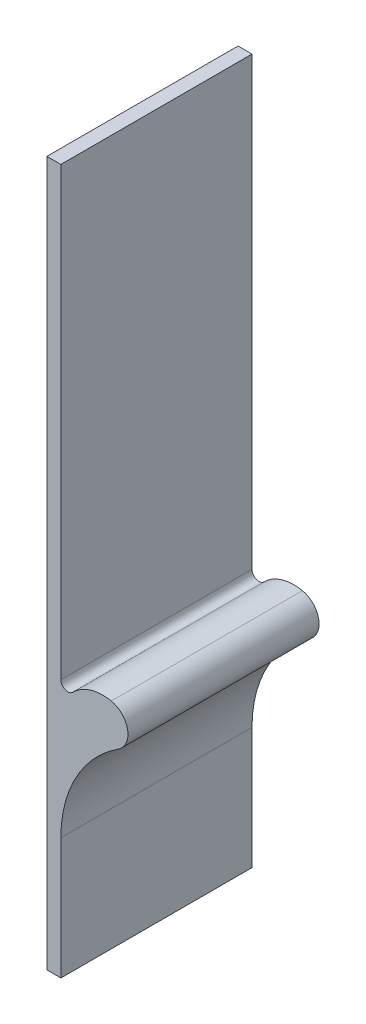
ISO-10303-21;
HEADER;
FILE_DESCRIPTION(('STEP AP214'),'2;1');
FILE_NAME('part.step','',(''),(''),'','','');
FILE_SCHEMA(('AUTOMOTIVE_DESIGN { 1 0 10303 214 1 1 1 1 }'));
ENDSEC;
DATA;
#1=APPLICATION_CONTEXT('core data for automotive mechanical design processes');
#2=APPLICATION_PROTOCOL_DEFINITION('international standard','automotive_design',2000,#1);
#3=PRODUCT_CONTEXT('',#1,'mechanical');
#4=PRODUCT('Part','Part','',(#3));
#5=PRODUCT_RELATED_PRODUCT_CATEGORY('part','',(#4));
#6=PRODUCT_DEFINITION_FORMATION('','',#4);
#7=PRODUCT_DEFINITION_CONTEXT('part definition',#1,'design');
#8=PRODUCT_DEFINITION('design','',#6,#7);
#9=PRODUCT_DEFINITION_SHAPE('','',#8);
#10=(LENGTH_UNIT() NAMED_UNIT(*) SI_UNIT(.MILLI.,.METRE.));
#11=(NAMED_UNIT(*) PLANE_ANGLE_UNIT() SI_UNIT($,.RADIAN.));
#12=(NAMED_UNIT(*) SI_UNIT($,.STERADIAN.) SOLID_ANGLE_UNIT());
#13=UNCERTAINTY_MEASURE_WITH_UNIT(LENGTH_MEASURE(1.E-05),#10,'distance_accuracy_value','');
#14=(GEOMETRIC_REPRESENTATION_CONTEXT(3) GLOBAL_UNCERTAINTY_ASSIGNED_CONTEXT((#13)) GLOBAL_UNIT_ASSIGNED_CONTEXT((#10,
#11,#12)) REPRESENTATION_CONTEXT('',''));
#15=CARTESIAN_POINT('',(0.,0.,0.));
#16=DIRECTION('',(0.,0.,1.));
#17=DIRECTION('',(1.,0.,0.));
#18=AXIS2_PLACEMENT_3D('',#15,#16,#17);
#19=CARTESIAN_POINT('',(162.,-79.9866466970703,-133.266873352892));
#20=DIRECTION('',(0.,0.,1.));
#21=DIRECTION('',(1.,0.,0.));
#22=AXIS2_PLACEMENT_3D('',#19,#20,#21);
#23=CYLINDRICAL_SURFACE('',#22,0.5);
#24=DIRECTION('',(0.,0.,1.));
#25=VECTOR('',#24,1.);
#26=CARTESIAN_POINT('',(162.357142857143,-80.3365738031821,-133.266873352892));
#27=LINE('',#26,#25);
#28=CARTESIAN_POINT('',(162.357142857143,-80.3365738031821,-121.85));
#29=VERTEX_POINT('',#28);
#30=CARTESIAN_POINT('',(162.357142857139,-80.3365738031858,-108.15));
#31=VERTEX_POINT('',#30);
#32=EDGE_CURVE('E167',#29,#31,#27,.T.);
#33=ORIENTED_EDGE('',*,*,#32,.F.);
#34=CARTESIAN_POINT('',(162.,-79.9866466970703,-121.85));
#35=DIRECTION('',(0.,0.,-1.));
#36=DIRECTION('',(-1.,0.,0.));
#37=AXIS2_PLACEMENT_3D('',#34,#35,#36);
#38=CIRCLE('',#37,0.5);
#39=CARTESIAN_POINT('',(161.5,-79.9866466970703,-121.85));
#40=VERTEX_POINT('',#39);
#41=EDGE_CURVE('E40',#29,#40,#38,.T.);
#42=ORIENTED_EDGE('',*,*,#41,.T.);
#43=DIRECTION('',(0.,0.,-1.));
#44=VECTOR('',#43,1.);
#45=CARTESIAN_POINT('',(161.5,-79.9866466970703,-133.266873352892));
#46=LINE('',#45,#44);
#47=CARTESIAN_POINT('',(161.5,-79.9866466970703,-108.15));
#48=VERTEX_POINT('',#47);
#49=EDGE_CURVE('E169',#48,#40,#46,.T.);
#50=ORIENTED_EDGE('',*,*,#49,.F.);
#51=CARTESIAN_POINT('',(162.,-79.9866466970703,-108.15));
#52=DIRECTION('',(0.,0.,1.));
#53=DIRECTION('',(1.,0.,0.));
#54=AXIS2_PLACEMENT_3D('',#51,#52,#53);
#55=CIRCLE('',#54,0.5);
#56=EDGE_CURVE('E11',#48,#31,#55,.T.);
#57=ORIENTED_EDGE('',*,*,#56,.T.);
#58=EDGE_LOOP('',(#33,#42,#50,#57));
#59=FACE_BOUND('',#58,.T.);
#60=ADVANCED_FACE('F33',(#59),#23,.F.);
#61=CARTESIAN_POINT('',(161.5,-33.7635521331024,-121.85));
#62=DIRECTION('',(1.,0.,0.));
#63=DIRECTION('',(0.,0.,-1.));
#64=AXIS2_PLACEMENT_3D('',#61,#62,#63);
#65=PLANE('',#64);
#66=DIRECTION('',(0.,-1.,0.));
#67=VECTOR('',#66,1.);
#68=CARTESIAN_POINT('',(161.5,-33.7635521331024,-108.15));
#69=LINE('',#68,#67);
#70=CARTESIAN_POINT('',(161.5,-48.,-108.15));
#71=VERTEX_POINT('',#70);
#72=EDGE_CURVE('E158',#71,#48,#69,.T.);
#73=ORIENTED_EDGE('',*,*,#72,.T.);
#74=ORIENTED_EDGE('',*,*,#49,.T.);
#75=DIRECTION('',(0.,-1.,0.));
#76=VECTOR('',#75,1.);
#77=CARTESIAN_POINT('',(161.5,-33.7635521331024,-121.85));
#78=LINE('',#77,#76);
#79=CARTESIAN_POINT('',(161.5,-48.,-121.85));
#80=VERTEX_POINT('',#79);
#81=EDGE_CURVE('E162',#80,#40,#78,.T.);
#82=ORIENTED_EDGE('',*,*,#81,.F.);
#83=DIRECTION('',(0.,0.,-1.));
#84=VECTOR('',#83,1.);
#85=CARTESIAN_POINT('',(161.5,-48.,-121.85));
#86=LINE('',#85,#84);
#87=EDGE_CURVE('E137',#71,#80,#86,.T.);
#88=ORIENTED_EDGE('',*,*,#87,.F.);
#89=EDGE_LOOP('',(#73,#74,#82,#88));
#90=FACE_BOUND('',#89,.T.);
#91=ADVANCED_FACE('F172',(#90),#65,.T.);
#92=CARTESIAN_POINT('',(160.5,-33.7635521331024,-121.85));
#93=DIRECTION('',(-1.,0.,0.));
#94=DIRECTION('',(0.,0.,1.));
#95=AXIS2_PLACEMENT_3D('',#92,#93,#94);
#96=PLANE('',#95);
#97=DIRECTION('',(0.,0.,1.));
#98=VECTOR('',#97,1.);
#99=CARTESIAN_POINT('',(160.5,-48.,-121.85));
#100=LINE('',#99,#98);
#101=CARTESIAN_POINT('',(160.5,-48.,-121.85));
#102=VERTEX_POINT('',#101);
#103=CARTESIAN_POINT('',(160.5,-48.,-108.15));
#104=VERTEX_POINT('',#103);
#105=EDGE_CURVE('E142',#102,#104,#100,.T.);
#106=ORIENTED_EDGE('',*,*,#105,.F.);
#107=DIRECTION('',(0.,-1.,0.));
#108=VECTOR('',#107,1.);
#109=CARTESIAN_POINT('',(160.5,-33.7635521331024,-121.85));
#110=LINE('',#109,#108);
#111=CARTESIAN_POINT('',(160.5,-98.5,-121.85));
#112=VERTEX_POINT('',#111);
#113=EDGE_CURVE('E156',#102,#112,#110,.T.);
#114=ORIENTED_EDGE('',*,*,#113,.T.);
#115=DIRECTION('',(0.,0.,-1.));
#116=VECTOR('',#115,1.);
#117=CARTESIAN_POINT('',(160.5,-98.5,-121.85));
#118=LINE('',#117,#116);
#119=CARTESIAN_POINT('',(160.5,-98.5,-108.15));
#120=VERTEX_POINT('',#119);
#121=EDGE_CURVE('E136',#120,#112,#118,.T.);
#122=ORIENTED_EDGE('',*,*,#121,.F.);
#123=DIRECTION('',(0.,-1.,0.));
#124=VECTOR('',#123,1.);
#125=CARTESIAN_POINT('',(160.5,-33.7635521331024,-108.15));
#126=LINE('',#125,#124);
#127=EDGE_CURVE('E140',#104,#120,#126,.T.);
#128=ORIENTED_EDGE('',*,*,#127,.F.);
#129=EDGE_LOOP('',(#106,#114,#122,#128));
#130=FACE_BOUND('',#129,.T.);
#131=ADVANCED_FACE('F182',(#130),#96,.T.);
#132=CARTESIAN_POINT('',(160.5,-33.7635521331024,-108.15));
#133=DIRECTION('',(0.,0.,1.));
#134=DIRECTION('',(1.,0.,0.));
#135=AXIS2_PLACEMENT_3D('',#132,#133,#134);
#136=PLANE('',#135);
#137=DIRECTION('',(1.,0.,0.));
#138=VECTOR('',#137,1.);
#139=CARTESIAN_POINT('',(160.5,-48.,-108.15));
#140=LINE('',#139,#138);
#141=EDGE_CURVE('E139',#104,#71,#140,.T.);
#142=ORIENTED_EDGE('',*,*,#141,.F.);
#143=ORIENTED_EDGE('',*,*,#127,.T.);
#144=DIRECTION('',(-1.,0.,0.));
#145=VECTOR('',#144,1.);
#146=CARTESIAN_POINT('',(160.5,-98.5,-108.15));
#147=LINE('',#146,#145);
#148=CARTESIAN_POINT('',(161.5,-98.5,-108.15));
#149=VERTEX_POINT('',#148);
#150=EDGE_CURVE('E153',#149,#120,#147,.T.);
#151=ORIENTED_EDGE('',*,*,#150,.F.);
#152=CARTESIAN_POINT('',(161.5,-89.7913048029506,-108.15));
#153=VERTEX_POINT('',#152);
#154=EDGE_CURVE('E161',#153,#149,#69,.T.);
#155=ORIENTED_EDGE('',*,*,#154,.F.);
#156=CARTESIAN_POINT('',(170.5,-89.7913048029507,-108.15));
#157=DIRECTION('',(0.,0.,-1.));
#158=DIRECTION('',(-1.,0.,0.));
#159=AXIS2_PLACEMENT_3D('',#156,#157,#158);
#160=CIRCLE('',#159,9.00000000000001);
#161=CARTESIAN_POINT('',(165.621019964404,-82.2285305889302,-108.15));
#162=VERTEX_POINT('',#161);
#163=EDGE_CURVE('E129',#153,#162,#160,.T.);
#164=ORIENTED_EDGE('',*,*,#163,.T.);
#165=CARTESIAN_POINT('',(164.807856625138,-80.9680682199267,-108.15));
#166=DIRECTION('',(0.,0.,1.));
#167=DIRECTION('',(1.,0.,0.));
#168=AXIS2_PLACEMENT_3D('',#165,#166,#167);
#169=CIRCLE('',#168,1.5);
#170=CARTESIAN_POINT('',(165.115713250276,-79.5000000000001,-108.15));
#171=VERTEX_POINT('',#170);
#172=EDGE_CURVE('E125',#162,#171,#169,.T.);
#173=ORIENTED_EDGE('',*,*,#172,.T.);
#174=CARTESIAN_POINT('',(164.5,-82.4361364398534,-108.15));
#175=DIRECTION('',(0.,0.,1.));
#176=DIRECTION('',(1.,0.,0.));
#177=AXIS2_PLACEMENT_3D('',#174,#175,#176);
#178=CIRCLE('',#177,2.99999999999995);
#179=EDGE_CURVE('E116',#171,#31,#178,.T.);
#180=ORIENTED_EDGE('',*,*,#179,.T.);
#181=ORIENTED_EDGE('',*,*,#56,.F.);
#182=ORIENTED_EDGE('',*,*,#72,.F.);
#183=EDGE_LOOP('',(#142,#143,#151,#155,#164,#173,#180,#181,#182));
#184=FACE_BOUND('',#183,.T.);
#185=ADVANCED_FACE('F185',(#184),#136,.T.);
#186=DIRECTION('',(0.,0.,1.));
#187=VECTOR('',#186,1.);
#188=CARTESIAN_POINT('',(161.5,-89.7913048029506,-133.266873352892));
#189=LINE('',#188,#187);
#190=CARTESIAN_POINT('',(161.5,-89.7913048029507,-121.85));
#191=VERTEX_POINT('',#190);
#192=EDGE_CURVE('E111',#191,#153,#189,.T.);
#193=ORIENTED_EDGE('',*,*,#192,.T.);
#194=ORIENTED_EDGE('',*,*,#154,.T.);
#195=DIRECTION('',(0.,0.,1.));
#196=VECTOR('',#195,1.);
#197=CARTESIAN_POINT('',(161.5,-98.5,-121.85));
#198=LINE('',#197,#196);
#199=CARTESIAN_POINT('',(161.5,-98.5,-121.85));
#200=VERTEX_POINT('',#199);
#201=EDGE_CURVE('E150',#200,#149,#198,.T.);
#202=ORIENTED_EDGE('',*,*,#201,.F.);
#203=EDGE_CURVE('E164',#191,#200,#78,.T.);
#204=ORIENTED_EDGE('',*,*,#203,.F.);
#205=EDGE_LOOP('',(#193,#194,#202,#204));
#206=FACE_BOUND('',#205,.T.);
#207=ADVANCED_FACE('F193',(#206),#65,.T.);
#208=CARTESIAN_POINT('',(160.5,-33.7635521331024,-121.85));
#209=DIRECTION('',(0.,0.,-1.));
#210=DIRECTION('',(-1.,0.,0.));
#211=AXIS2_PLACEMENT_3D('',#208,#209,#210);
#212=PLANE('',#211);
#213=DIRECTION('',(-1.,0.,0.));
#214=VECTOR('',#213,1.);
#215=CARTESIAN_POINT('',(160.5,-48.,-121.85));
#216=LINE('',#215,#214);
#217=EDGE_CURVE('E144',#80,#102,#216,.T.);
#218=ORIENTED_EDGE('',*,*,#217,.F.);
#219=ORIENTED_EDGE('',*,*,#81,.T.);
#220=ORIENTED_EDGE('',*,*,#41,.F.);
#221=CARTESIAN_POINT('',(164.5,-82.4361364398534,-121.85));
#222=DIRECTION('',(0.,0.,-1.));
#223=DIRECTION('',(-1.,0.,0.));
#224=AXIS2_PLACEMENT_3D('',#221,#222,#223);
#225=CIRCLE('',#224,2.99999999999995);
#226=CARTESIAN_POINT('',(165.115713250276,-79.5000000000001,-121.85));
#227=VERTEX_POINT('',#226);
#228=EDGE_CURVE('E100',#227,#29,#225,.F.);
#229=ORIENTED_EDGE('',*,*,#228,.F.);
#230=CARTESIAN_POINT('',(164.807856625138,-80.9680682199267,-121.85));
#231=DIRECTION('',(0.,0.,-1.));
#232=DIRECTION('',(-1.,0.,0.));
#233=AXIS2_PLACEMENT_3D('',#230,#231,#232);
#234=CIRCLE('',#233,1.5);
#235=CARTESIAN_POINT('',(165.621019964404,-82.2285305889302,-121.85));
#236=VERTEX_POINT('',#235);
#237=EDGE_CURVE('E106',#236,#227,#234,.F.);
#238=ORIENTED_EDGE('',*,*,#237,.F.);
#239=CARTESIAN_POINT('',(170.5,-89.7913048029507,-121.85));
#240=DIRECTION('',(0.,0.,-1.));
#241=DIRECTION('',(-1.,0.,0.));
#242=AXIS2_PLACEMENT_3D('',#239,#240,#241);
#243=CIRCLE('',#242,9.00000000000001);
#244=EDGE_CURVE('E131',#191,#236,#243,.T.);
#245=ORIENTED_EDGE('',*,*,#244,.F.);
#246=ORIENTED_EDGE('',*,*,#203,.T.);
#247=DIRECTION('',(1.,0.,0.));
#248=VECTOR('',#247,1.);
#249=CARTESIAN_POINT('',(160.5,-98.5,-121.85));
#250=LINE('',#249,#248);
#251=EDGE_CURVE('E147',#112,#200,#250,.T.);
#252=ORIENTED_EDGE('',*,*,#251,.F.);
#253=ORIENTED_EDGE('',*,*,#113,.F.);
#254=EDGE_LOOP('',(#218,#219,#220,#229,#238,#245,#246,#252,#253));
#255=FACE_BOUND('',#254,.T.);
#256=ADVANCED_FACE('F103',(#255),#212,.T.);
#257=CARTESIAN_POINT('',(0.,-98.5,0.));
#258=DIRECTION('',(0.,1.,0.));
#259=DIRECTION('',(0.,0.,1.));
#260=AXIS2_PLACEMENT_3D('',#257,#258,#259);
#261=PLANE('',#260);
#262=ORIENTED_EDGE('',*,*,#121,.T.);
#263=ORIENTED_EDGE('',*,*,#251,.T.);
#264=ORIENTED_EDGE('',*,*,#201,.T.);
#265=ORIENTED_EDGE('',*,*,#150,.T.);
#266=EDGE_LOOP('',(#262,#263,#264,#265));
#267=FACE_BOUND('',#266,.T.);
#268=ADVANCED_FACE('F189',(#267),#261,.F.);
#269=CARTESIAN_POINT('',(163.5,-48.,-123.95));
#270=DIRECTION('',(0.,-1.,0.));
#271=DIRECTION('',(0.,0.,-1.));
#272=AXIS2_PLACEMENT_3D('',#269,#270,#271);
#273=PLANE('',#272);
#274=ORIENTED_EDGE('',*,*,#105,.T.);
#275=ORIENTED_EDGE('',*,*,#141,.T.);
#276=ORIENTED_EDGE('',*,*,#87,.T.);
#277=ORIENTED_EDGE('',*,*,#217,.T.);
#278=EDGE_LOOP('',(#274,#275,#276,#277));
#279=FACE_BOUND('',#278,.T.);
#280=ADVANCED_FACE('F178',(#279),#273,.F.);
#281=CARTESIAN_POINT('',(164.807856625138,-80.9680682199267,-133.266873352892));
#282=DIRECTION('',(0.,0.,1.));
#283=DIRECTION('',(1.,0.,0.));
#284=AXIS2_PLACEMENT_3D('',#281,#282,#283);
#285=CYLINDRICAL_SURFACE('',#284,1.5);
#286=DIRECTION('',(0.,0.,1.));
#287=VECTOR('',#286,1.);
#288=CARTESIAN_POINT('',(165.621019964404,-82.2285305889302,-133.266873352892));
#289=LINE('',#288,#287);
#290=EDGE_CURVE('E123',#236,#162,#289,.T.);
#291=ORIENTED_EDGE('',*,*,#290,.F.);
#292=ORIENTED_EDGE('',*,*,#237,.T.);
#293=DIRECTION('',(0.,0.,1.));
#294=VECTOR('',#293,1.);
#295=CARTESIAN_POINT('',(165.115713250276,-79.5000000000001,-133.266873352892));
#296=LINE('',#295,#294);
#297=EDGE_CURVE('E112',#227,#171,#296,.T.);
#298=ORIENTED_EDGE('',*,*,#297,.T.);
#299=ORIENTED_EDGE('',*,*,#172,.F.);
#300=EDGE_LOOP('',(#291,#292,#298,#299));
#301=FACE_BOUND('',#300,.T.);
#302=ADVANCED_FACE('F122',(#301),#285,.T.);
#303=CARTESIAN_POINT('',(164.5,-82.4361364398534,-133.266873352892));
#304=DIRECTION('',(0.,0.,1.));
#305=DIRECTION('',(1.,0.,0.));
#306=AXIS2_PLACEMENT_3D('',#303,#304,#305);
#307=CYLINDRICAL_SURFACE('',#306,2.99999999999995);
#308=ORIENTED_EDGE('',*,*,#228,.T.);
#309=ORIENTED_EDGE('',*,*,#32,.T.);
#310=ORIENTED_EDGE('',*,*,#179,.F.);
#311=ORIENTED_EDGE('',*,*,#297,.F.);
#312=EDGE_LOOP('',(#308,#309,#310,#311));
#313=FACE_BOUND('',#312,.T.);
#314=ADVANCED_FACE('F115',(#313),#307,.T.);
#315=CARTESIAN_POINT('',(170.5,-89.7913048029507,-133.266873352892));
#316=DIRECTION('',(0.,0.,1.));
#317=DIRECTION('',(1.,0.,0.));
#318=AXIS2_PLACEMENT_3D('',#315,#316,#317);
#319=CYLINDRICAL_SURFACE('',#318,9.00000000000001);
#320=ORIENTED_EDGE('',*,*,#192,.F.);
#321=ORIENTED_EDGE('',*,*,#244,.T.);
#322=ORIENTED_EDGE('',*,*,#290,.T.);
#323=ORIENTED_EDGE('',*,*,#163,.F.);
#324=EDGE_LOOP('',(#320,#321,#322,#323));
#325=FACE_BOUND('',#324,.T.);
#326=ADVANCED_FACE('F195',(#325),#319,.F.);
#327=CLOSED_SHELL('',(#60,#91,#131,#185,#207,#256,#268,#280,#302,#314,#326));
#328=MANIFOLD_SOLID_BREP('B2',#327);
#329=ADVANCED_BREP_SHAPE_REPRESENTATION('',(#18,#328),#14);
#330=SHAPE_DEFINITION_REPRESENTATION(#9,#329);
ENDSEC;
END-ISO-10303-21;
